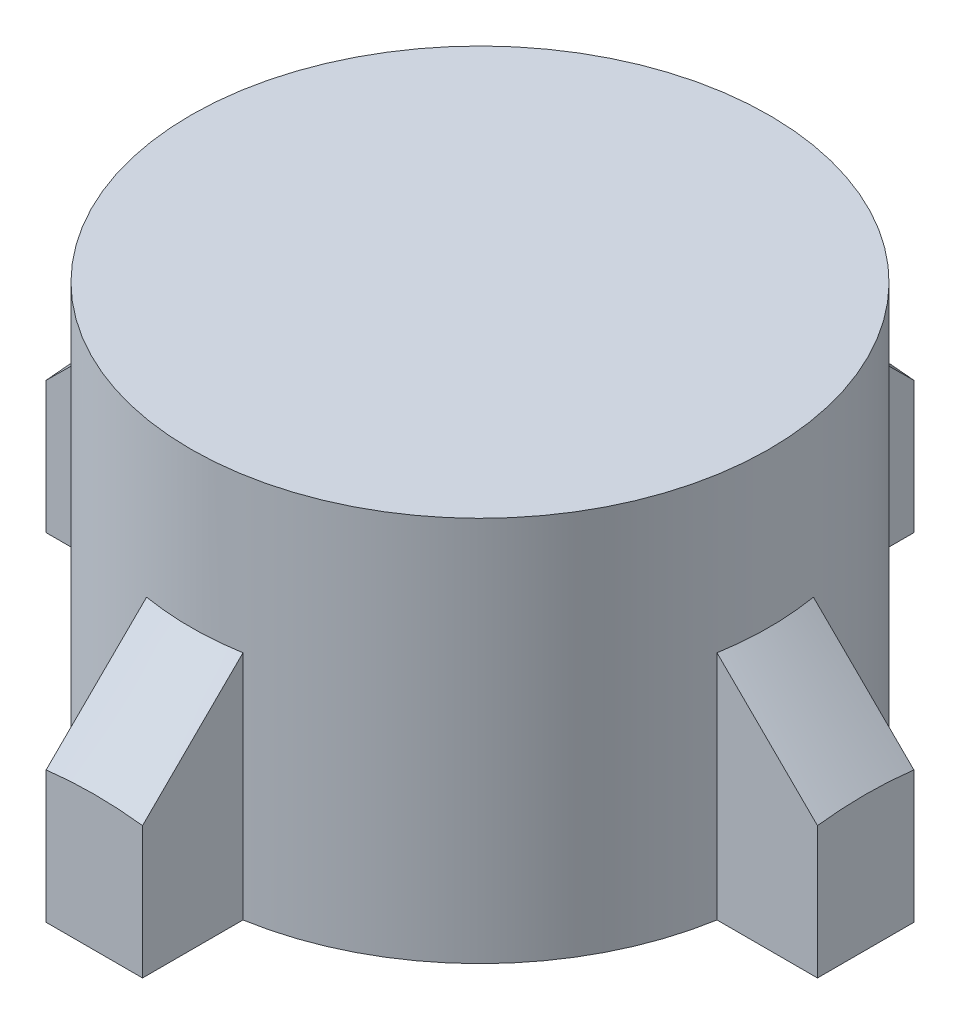
ISO-10303-21;
HEADER;
FILE_DESCRIPTION(('STEP AP214'),'2;1');
FILE_NAME('part.step','',(''),(''),'','','');
FILE_SCHEMA(('AUTOMOTIVE_DESIGN { 1 0 10303 214 1 1 1 1 }'));
ENDSEC;
DATA;
#1=APPLICATION_CONTEXT('core data for automotive mechanical design processes');
#2=APPLICATION_PROTOCOL_DEFINITION('international standard','automotive_design',2000,#1);
#3=PRODUCT_CONTEXT('',#1,'mechanical');
#4=PRODUCT('Part','Part','',(#3));
#5=PRODUCT_RELATED_PRODUCT_CATEGORY('part','',(#4));
#6=PRODUCT_DEFINITION_FORMATION('','',#4);
#7=PRODUCT_DEFINITION_CONTEXT('part definition',#1,'design');
#8=PRODUCT_DEFINITION('design','',#6,#7);
#9=PRODUCT_DEFINITION_SHAPE('','',#8);
#10=(LENGTH_UNIT() NAMED_UNIT(*) SI_UNIT(.MILLI.,.METRE.));
#11=(NAMED_UNIT(*) PLANE_ANGLE_UNIT() SI_UNIT($,.RADIAN.));
#12=(NAMED_UNIT(*) SI_UNIT($,.STERADIAN.) SOLID_ANGLE_UNIT());
#13=UNCERTAINTY_MEASURE_WITH_UNIT(LENGTH_MEASURE(1.E-05),#10,'distance_accuracy_value','');
#14=(GEOMETRIC_REPRESENTATION_CONTEXT(3) GLOBAL_UNCERTAINTY_ASSIGNED_CONTEXT((#13)) GLOBAL_UNIT_ASSIGNED_CONTEXT((#10,
#11,#12)) REPRESENTATION_CONTEXT('',''));
#15=CARTESIAN_POINT('',(0.,0.,0.));
#16=DIRECTION('',(0.,0.,1.));
#17=DIRECTION('',(1.,0.,0.));
#18=AXIS2_PLACEMENT_3D('',#15,#16,#17);
#19=CARTESIAN_POINT('',(0.,100.,0.));
#20=DIRECTION('',(0.,-1.,0.));
#21=DIRECTION('',(0.,0.,-1.));
#22=AXIS2_PLACEMENT_3D('',#19,#20,#21);
#23=CYLINDRICAL_SURFACE('',#22,75.);
#24=CARTESIAN_POINT('',(0.,100.,0.));
#25=DIRECTION('',(0.,1.,0.));
#26=DIRECTION('',(0.,0.,1.));
#27=AXIS2_PLACEMENT_3D('',#24,#25,#26);
#28=CIRCLE('',#27,75.);
#29=CARTESIAN_POINT('',(0.,100.,75.));
#30=VERTEX_POINT('',#29);
#31=EDGE_CURVE('E252',#30,#30,#28,.T.);
#32=ORIENTED_EDGE('',*,*,#31,.F.);
#33=EDGE_LOOP('',(#32));
#34=FACE_BOUND('',#33,.T.);
#35=DIRECTION('',(0.,-1.,0.));
#36=VECTOR('',#35,1.);
#37=CARTESIAN_POINT('',(12.5,10.,-73.9509972887452));
#38=LINE('',#37,#36);
#39=CARTESIAN_POINT('',(12.5,60.0000000000003,-73.9509972887452));
#40=VERTEX_POINT('',#39);
#41=CARTESIAN_POINT('',(12.5,0.,-73.9509972887452));
#42=VERTEX_POINT('',#41);
#43=EDGE_CURVE('E179',#40,#42,#38,.T.);
#44=ORIENTED_EDGE('',*,*,#43,.F.);
#45=CARTESIAN_POINT('',(0.,60.0000000000003,0.));
#46=DIRECTION('',(0.,-1.,0.));
#47=DIRECTION('',(0.,0.,-1.));
#48=AXIS2_PLACEMENT_3D('',#45,#46,#47);
#49=CIRCLE('',#48,75.);
#50=CARTESIAN_POINT('',(-12.5,60.0000000000003,-73.9509972887452));
#51=VERTEX_POINT('',#50);
#52=EDGE_CURVE('E268',#40,#51,#49,.F.);
#53=ORIENTED_EDGE('',*,*,#52,.T.);
#54=DIRECTION('',(0.,-1.,0.));
#55=VECTOR('',#54,1.);
#56=CARTESIAN_POINT('',(-12.5,10.,-73.9509972887452));
#57=LINE('',#56,#55);
#58=CARTESIAN_POINT('',(-12.5,0.,-73.9509972887452));
#59=VERTEX_POINT('',#58);
#60=EDGE_CURVE('E197',#51,#59,#57,.T.);
#61=ORIENTED_EDGE('',*,*,#60,.T.);
#62=CARTESIAN_POINT('',(0.,0.,0.));
#63=DIRECTION('',(0.,1.,0.));
#64=DIRECTION('',(0.,0.,1.));
#65=AXIS2_PLACEMENT_3D('',#62,#63,#64);
#66=CIRCLE('',#65,75.);
#67=CARTESIAN_POINT('',(-73.9509972887452,0.,-12.5));
#68=VERTEX_POINT('',#67);
#69=EDGE_CURVE('E246',#59,#68,#66,.T.);
#70=ORIENTED_EDGE('',*,*,#69,.T.);
#71=DIRECTION('',(0.,-1.,0.));
#72=VECTOR('',#71,1.);
#73=CARTESIAN_POINT('',(-73.9509972887452,10.,-12.5));
#74=LINE('',#73,#72);
#75=CARTESIAN_POINT('',(-73.9509972887452,60.0000000000003,-12.5));
#76=VERTEX_POINT('',#75);
#77=EDGE_CURVE('E247',#76,#68,#74,.T.);
#78=ORIENTED_EDGE('',*,*,#77,.F.);
#79=CARTESIAN_POINT('',(0.,60.0000000000003,0.));
#80=DIRECTION('',(0.,-1.,0.));
#81=DIRECTION('',(0.,0.,-1.));
#82=AXIS2_PLACEMENT_3D('',#79,#80,#81);
#83=CIRCLE('',#82,75.);
#84=CARTESIAN_POINT('',(-73.9509972887452,60.0000000000003,12.5));
#85=VERTEX_POINT('',#84);
#86=EDGE_CURVE('E255',#76,#85,#83,.F.);
#87=ORIENTED_EDGE('',*,*,#86,.T.);
#88=DIRECTION('',(0.,-1.,0.));
#89=VECTOR('',#88,1.);
#90=CARTESIAN_POINT('',(-73.9509972887452,10.,12.5));
#91=LINE('',#90,#89);
#92=CARTESIAN_POINT('',(-73.9509972887452,0.,12.5));
#93=VERTEX_POINT('',#92);
#94=EDGE_CURVE('E243',#85,#93,#91,.T.);
#95=ORIENTED_EDGE('',*,*,#94,.T.);
#96=CARTESIAN_POINT('',(-12.5,0.,73.9509972887452));
#97=VERTEX_POINT('',#96);
#98=EDGE_CURVE('E256',#93,#97,#66,.T.);
#99=ORIENTED_EDGE('',*,*,#98,.T.);
#100=DIRECTION('',(0.,-1.,0.));
#101=VECTOR('',#100,1.);
#102=CARTESIAN_POINT('',(-12.5,10.,73.9509972887452));
#103=LINE('',#102,#101);
#104=CARTESIAN_POINT('',(-12.5,60.0000000000004,73.9509972887452));
#105=VERTEX_POINT('',#104);
#106=EDGE_CURVE('E209',#105,#97,#103,.T.);
#107=ORIENTED_EDGE('',*,*,#106,.F.);
#108=CARTESIAN_POINT('',(0.,60.0000000000004,0.));
#109=DIRECTION('',(0.,-1.,0.));
#110=DIRECTION('',(0.,0.,-1.));
#111=AXIS2_PLACEMENT_3D('',#108,#109,#110);
#112=CIRCLE('',#111,75.);
#113=CARTESIAN_POINT('',(12.5,60.0000000000004,73.9509972887452));
#114=VERTEX_POINT('',#113);
#115=EDGE_CURVE('E262',#105,#114,#112,.F.);
#116=ORIENTED_EDGE('',*,*,#115,.T.);
#117=DIRECTION('',(0.,-1.,0.));
#118=VECTOR('',#117,1.);
#119=CARTESIAN_POINT('',(12.5,10.,73.9509972887452));
#120=LINE('',#119,#118);
#121=CARTESIAN_POINT('',(12.5,0.,73.9509972887452));
#122=VERTEX_POINT('',#121);
#123=EDGE_CURVE('E208',#114,#122,#120,.T.);
#124=ORIENTED_EDGE('',*,*,#123,.T.);
#125=CARTESIAN_POINT('',(73.9509972887452,0.,12.5));
#126=VERTEX_POINT('',#125);
#127=EDGE_CURVE('E258',#122,#126,#66,.T.);
#128=ORIENTED_EDGE('',*,*,#127,.T.);
#129=DIRECTION('',(0.,-1.,0.));
#130=VECTOR('',#129,1.);
#131=CARTESIAN_POINT('',(73.9509972887452,10.,12.5));
#132=LINE('',#131,#130);
#133=CARTESIAN_POINT('',(73.9509972887452,60.0000000000003,12.5));
#134=VERTEX_POINT('',#133);
#135=EDGE_CURVE('E231',#134,#126,#132,.T.);
#136=ORIENTED_EDGE('',*,*,#135,.F.);
#137=CARTESIAN_POINT('',(0.,60.0000000000003,0.));
#138=DIRECTION('',(0.,-1.,0.));
#139=DIRECTION('',(0.,0.,-1.));
#140=AXIS2_PLACEMENT_3D('',#137,#138,#139);
#141=CIRCLE('',#140,75.);
#142=CARTESIAN_POINT('',(73.9509972887452,60.0000000000003,-12.5));
#143=VERTEX_POINT('',#142);
#144=EDGE_CURVE('E265',#134,#143,#141,.F.);
#145=ORIENTED_EDGE('',*,*,#144,.T.);
#146=DIRECTION('',(0.,-1.,0.));
#147=VECTOR('',#146,1.);
#148=CARTESIAN_POINT('',(73.9509972887452,10.,-12.5));
#149=LINE('',#148,#147);
#150=CARTESIAN_POINT('',(73.9509972887452,0.,-12.5));
#151=VERTEX_POINT('',#150);
#152=EDGE_CURVE('E227',#143,#151,#149,.T.);
#153=ORIENTED_EDGE('',*,*,#152,.T.);
#154=EDGE_CURVE('E259',#151,#42,#66,.T.);
#155=ORIENTED_EDGE('',*,*,#154,.T.);
#156=EDGE_LOOP('',(#44,#53,#61,#70,#78,#87,#95,#99,#107,#116,#124,#128,#136,#145,#153,#155));
#157=FACE_BOUND('',#156,.T.);
#158=ADVANCED_FACE('F40',(#34,#157),#23,.T.);
#159=CARTESIAN_POINT('',(0.,100.,0.));
#160=DIRECTION('',(0.,1.,0.));
#161=DIRECTION('',(0.,0.,1.));
#162=AXIS2_PLACEMENT_3D('',#159,#160,#161);
#163=PLANE('',#162);
#164=ORIENTED_EDGE('',*,*,#31,.T.);
#165=EDGE_LOOP('',(#164));
#166=FACE_BOUND('',#165,.T.);
#167=ADVANCED_FACE('F422',(#166),#163,.T.);
#168=CARTESIAN_POINT('',(0.,0.,0.));
#169=DIRECTION('',(0.,1.,0.));
#170=DIRECTION('',(0.,0.,1.));
#171=AXIS2_PLACEMENT_3D('',#168,#169,#170);
#172=PLANE('',#171);
#173=ORIENTED_EDGE('',*,*,#98,.F.);
#174=DIRECTION('',(1.,0.,0.));
#175=VECTOR('',#174,1.);
#176=CARTESIAN_POINT('',(0.,0.,12.5));
#177=LINE('',#176,#175);
#178=CARTESIAN_POINT('',(-100.,0.,12.5));
#179=VERTEX_POINT('',#178);
#180=EDGE_CURVE('E230',#179,#93,#177,.T.);
#181=ORIENTED_EDGE('',*,*,#180,.F.);
#182=DIRECTION('',(0.,0.,1.));
#183=VECTOR('',#182,1.);
#184=CARTESIAN_POINT('',(-100.,0.,0.));
#185=LINE('',#184,#183);
#186=CARTESIAN_POINT('',(-100.,0.,-12.5));
#187=VERTEX_POINT('',#186);
#188=EDGE_CURVE('E238',#187,#179,#185,.T.);
#189=ORIENTED_EDGE('',*,*,#188,.F.);
#190=DIRECTION('',(1.,0.,0.));
#191=VECTOR('',#190,1.);
#192=CARTESIAN_POINT('',(0.,0.,-12.5));
#193=LINE('',#192,#191);
#194=EDGE_CURVE('E240',#187,#68,#193,.T.);
#195=ORIENTED_EDGE('',*,*,#194,.T.);
#196=ORIENTED_EDGE('',*,*,#69,.F.);
#197=DIRECTION('',(0.,0.,1.));
#198=VECTOR('',#197,1.);
#199=CARTESIAN_POINT('',(-12.5,0.,0.));
#200=LINE('',#199,#198);
#201=CARTESIAN_POINT('',(-12.5,0.,-100.));
#202=VERTEX_POINT('',#201);
#203=EDGE_CURVE('E180',#202,#59,#200,.T.);
#204=ORIENTED_EDGE('',*,*,#203,.F.);
#205=DIRECTION('',(1.,0.,0.));
#206=VECTOR('',#205,1.);
#207=CARTESIAN_POINT('',(0.,0.,-100.));
#208=LINE('',#207,#206);
#209=CARTESIAN_POINT('',(12.5,0.,-100.));
#210=VERTEX_POINT('',#209);
#211=EDGE_CURVE('E173',#202,#210,#208,.T.);
#212=ORIENTED_EDGE('',*,*,#211,.T.);
#213=DIRECTION('',(0.,0.,1.));
#214=VECTOR('',#213,1.);
#215=CARTESIAN_POINT('',(12.5,0.,0.));
#216=LINE('',#215,#214);
#217=EDGE_CURVE('E184',#210,#42,#216,.T.);
#218=ORIENTED_EDGE('',*,*,#217,.T.);
#219=ORIENTED_EDGE('',*,*,#154,.F.);
#220=DIRECTION('',(1.,0.,0.));
#221=VECTOR('',#220,1.);
#222=CARTESIAN_POINT('',(0.,0.,-12.5));
#223=LINE('',#222,#221);
#224=CARTESIAN_POINT('',(100.,0.,-12.5));
#225=VERTEX_POINT('',#224);
#226=EDGE_CURVE('E212',#151,#225,#223,.T.);
#227=ORIENTED_EDGE('',*,*,#226,.T.);
#228=DIRECTION('',(0.,0.,1.));
#229=VECTOR('',#228,1.);
#230=CARTESIAN_POINT('',(100.,0.,0.));
#231=LINE('',#230,#229);
#232=CARTESIAN_POINT('',(100.,0.,12.5));
#233=VERTEX_POINT('',#232);
#234=EDGE_CURVE('E222',#225,#233,#231,.T.);
#235=ORIENTED_EDGE('',*,*,#234,.T.);
#236=DIRECTION('',(1.,0.,0.));
#237=VECTOR('',#236,1.);
#238=CARTESIAN_POINT('',(0.,0.,12.5));
#239=LINE('',#238,#237);
#240=EDGE_CURVE('E225',#126,#233,#239,.T.);
#241=ORIENTED_EDGE('',*,*,#240,.F.);
#242=ORIENTED_EDGE('',*,*,#127,.F.);
#243=DIRECTION('',(0.,0.,1.));
#244=VECTOR('',#243,1.);
#245=CARTESIAN_POINT('',(12.5,0.,0.));
#246=LINE('',#245,#244);
#247=CARTESIAN_POINT('',(12.5,0.,100.));
#248=VERTEX_POINT('',#247);
#249=EDGE_CURVE('E196',#122,#248,#246,.T.);
#250=ORIENTED_EDGE('',*,*,#249,.T.);
#251=DIRECTION('',(1.,0.,0.));
#252=VECTOR('',#251,1.);
#253=CARTESIAN_POINT('',(0.,0.,100.));
#254=LINE('',#253,#252);
#255=CARTESIAN_POINT('',(-12.5,0.,100.));
#256=VERTEX_POINT('',#255);
#257=EDGE_CURVE('E203',#256,#248,#254,.T.);
#258=ORIENTED_EDGE('',*,*,#257,.F.);
#259=DIRECTION('',(0.,0.,1.));
#260=VECTOR('',#259,1.);
#261=CARTESIAN_POINT('',(-12.5,0.,0.));
#262=LINE('',#261,#260);
#263=EDGE_CURVE('E206',#97,#256,#262,.T.);
#264=ORIENTED_EDGE('',*,*,#263,.F.);
#265=EDGE_LOOP('',(#173,#181,#189,#195,#196,#204,#212,#218,#219,#227,#235,#241,#242,#250,#258,#264));
#266=FACE_BOUND('',#265,.T.);
#267=ADVANCED_FACE('F189',(#266),#172,.F.);
#268=CARTESIAN_POINT('',(0.,10.,12.5));
#269=DIRECTION('',(0.,0.,-1.));
#270=DIRECTION('',(-1.,0.,0.));
#271=AXIS2_PLACEMENT_3D('',#268,#269,#270);
#272=PLANE('',#271);
#273=ORIENTED_EDGE('',*,*,#180,.T.);
#274=ORIENTED_EDGE('',*,*,#94,.F.);
#275=CARTESIAN_POINT('',(-73.9509972887452,60.0000000000003,12.5));
#276=CARTESIAN_POINT('',(-76.125623231716,57.8557341187043,12.5));
#277=CARTESIAN_POINT('',(-78.2989925500493,55.7101948254983,12.5));
#278=CARTESIAN_POINT('',(-82.6436690014868,51.4170317982834,12.5));
#279=CARTESIAN_POINT('',(-84.814976135841,49.2694080655395,12.5));
#280=CARTESIAN_POINT('',(-89.1559813949117,44.9725364599919,12.5));
#281=CARTESIAN_POINT('',(-91.3256795200175,42.8232885875816,12.5));
#282=CARTESIAN_POINT('',(-95.6637570321255,38.5234596989376,12.5));
#283=CARTESIAN_POINT('',(-97.8321364183319,36.372878681901,12.5));
#284=CARTESIAN_POINT('',(-100.,34.2217781462687,12.5));
#285=B_SPLINE_CURVE_WITH_KNOTS('',3,(#275,#276,#277,#278,#279,#280,#281,#282,#283,#284),
.UNSPECIFIED.,.F.,.F.,(4,2,2,2,4),(0.,9.16197791707591,18.3239502767957,27.4859204184365,
36.6478960833256),.UNSPECIFIED.);
#286=CARTESIAN_POINT('',(-100.,34.2217781462687,12.5));
#287=VERTEX_POINT('',#286);
#288=EDGE_CURVE('E11',#85,#287,#285,.T.);
#289=ORIENTED_EDGE('',*,*,#288,.T.);
#290=DIRECTION('',(0.,-1.,0.));
#291=VECTOR('',#290,1.);
#292=CARTESIAN_POINT('',(-100.,10.,12.5));
#293=LINE('',#292,#291);
#294=EDGE_CURVE('E62',#287,#179,#293,.T.);
#295=ORIENTED_EDGE('',*,*,#294,.T.);
#296=EDGE_LOOP('',(#273,#274,#289,#295));
#297=FACE_BOUND('',#296,.T.);
#298=ADVANCED_FACE('F381',(#297),#272,.F.);
#299=CARTESIAN_POINT('',(0.,10.,-12.5));
#300=DIRECTION('',(0.,0.,-1.));
#301=DIRECTION('',(-1.,0.,0.));
#302=AXIS2_PLACEMENT_3D('',#299,#300,#301);
#303=PLANE('',#302);
#304=ORIENTED_EDGE('',*,*,#194,.F.);
#305=DIRECTION('',(0.,-1.,0.));
#306=VECTOR('',#305,1.);
#307=CARTESIAN_POINT('',(-100.,10.,-12.5));
#308=LINE('',#307,#306);
#309=CARTESIAN_POINT('',(-100.,34.2217781462687,-12.5));
#310=VERTEX_POINT('',#309);
#311=EDGE_CURVE('E70',#310,#187,#308,.T.);
#312=ORIENTED_EDGE('',*,*,#311,.F.);
#313=CARTESIAN_POINT('',(-100.,34.2217781462687,-12.5));
#314=CARTESIAN_POINT('',(-97.8321364183319,36.372878681901,-12.5));
#315=CARTESIAN_POINT('',(-95.6637570321255,38.5234596989376,-12.5));
#316=CARTESIAN_POINT('',(-91.3256795200175,42.8232885875816,-12.5));
#317=CARTESIAN_POINT('',(-89.1559813949117,44.9725364599919,-12.5));
#318=CARTESIAN_POINT('',(-84.814976135841,49.2694080655395,-12.5));
#319=CARTESIAN_POINT('',(-82.6436690014868,51.4170317982834,-12.5));
#320=CARTESIAN_POINT('',(-78.2989925500493,55.7101948254983,-12.5));
#321=CARTESIAN_POINT('',(-76.125623231716,57.8557341187043,-12.5));
#322=CARTESIAN_POINT('',(-73.9509972887452,60.0000000000003,-12.5));
#323=B_SPLINE_CURVE_WITH_KNOTS('',3,(#313,#314,#315,#316,#317,#318,#319,#320,#321,#322),
.UNSPECIFIED.,.F.,.F.,(4,2,2,2,4),(0.,9.16197566488912,18.3239458065299,27.4859181662497,
36.6478960833256),.UNSPECIFIED.);
#324=EDGE_CURVE('E55',#310,#76,#323,.T.);
#325=ORIENTED_EDGE('',*,*,#324,.T.);
#326=ORIENTED_EDGE('',*,*,#77,.T.);
#327=EDGE_LOOP('',(#304,#312,#325,#326));
#328=FACE_BOUND('',#327,.T.);
#329=ADVANCED_FACE('F377',(#328),#303,.T.);
#330=CARTESIAN_POINT('',(-100.,10.,0.));
#331=DIRECTION('',(1.,0.,0.));
#332=DIRECTION('',(0.,0.,-1.));
#333=AXIS2_PLACEMENT_3D('',#330,#331,#332);
#334=PLANE('',#333);
#335=ORIENTED_EDGE('',*,*,#188,.T.);
#336=ORIENTED_EDGE('',*,*,#294,.F.);
#337=CARTESIAN_POINT('',(-100.,34.2217781462687,12.5));
#338=CARTESIAN_POINT('',(-100.,34.3506081339298,11.4616275666102));
#339=CARTESIAN_POINT('',(-100.,34.4638094044752,10.4212987187302));
#340=CARTESIAN_POINT('',(-100.,34.6583725799966,8.33763969925141));
#341=CARTESIAN_POINT('',(-100.,34.7397335508538,7.29430944050269));
#342=CARTESIAN_POINT('',(-100.,34.8697755821144,5.20964362586226));
#343=CARTESIAN_POINT('',(-100.,34.9185813389614,4.16831587110397));
#344=CARTESIAN_POINT('',(-100.,34.9836933081245,2.08465873422579));
#345=CARTESIAN_POINT('',(-100.,35.0000000000006,1.04232936711289));
#346=CARTESIAN_POINT('',(-100.,35.0000000000006,-1.0423293671129));
#347=CARTESIAN_POINT('',(-100.,34.9836933081245,-2.0846587342258));
#348=CARTESIAN_POINT('',(-100.,34.9185813389614,-4.16831587110397));
#349=CARTESIAN_POINT('',(-100.,34.8697755821144,-5.20964362586226));
#350=CARTESIAN_POINT('',(-100.,34.7397335508538,-7.29430944050269));
#351=CARTESIAN_POINT('',(-100.,34.6583725799966,-8.33763969925142));
#352=CARTESIAN_POINT('',(-100.,34.4638094044752,-10.4212987187302));
#353=CARTESIAN_POINT('',(-100.,34.3506081339298,-11.4616275666102));
#354=CARTESIAN_POINT('',(-100.,34.2217781462687,-12.5));
#355=B_SPLINE_CURVE_WITH_KNOTS('',3,(#337,#338,#339,#340,#341,#342,#343,#344,#345,#346,#347,
#348,#349,#350,#351,#352,#353,#354),.UNSPECIFIED.,.F.,.F.,(4,2,2,2,2,2,2,2,4),(0.,
3.13890893259483,6.27790994642851,9.40481750559472,12.5316789234037,15.6585403412127,
18.7854479003789,21.9244489142126,25.0633578468074),.UNSPECIFIED.);
#356=EDGE_CURVE('E387',#287,#310,#355,.T.);
#357=ORIENTED_EDGE('',*,*,#356,.T.);
#358=ORIENTED_EDGE('',*,*,#311,.T.);
#359=EDGE_LOOP('',(#335,#336,#357,#358));
#360=FACE_BOUND('',#359,.T.);
#361=ADVANCED_FACE('F375',(#360),#334,.F.);
#362=CARTESIAN_POINT('',(0.,10.,-12.5));
#363=DIRECTION('',(0.,0.,-1.));
#364=DIRECTION('',(-1.,0.,0.));
#365=AXIS2_PLACEMENT_3D('',#362,#363,#364);
#366=PLANE('',#365);
#367=ORIENTED_EDGE('',*,*,#226,.F.);
#368=ORIENTED_EDGE('',*,*,#152,.F.);
#369=CARTESIAN_POINT('',(73.9509972887452,60.0000000000003,-12.5));
#370=CARTESIAN_POINT('',(76.125623231716,57.8557341187043,-12.5));
#371=CARTESIAN_POINT('',(78.2989925500493,55.7101948254984,-12.5));
#372=CARTESIAN_POINT('',(82.6436690014868,51.4170317982834,-12.5));
#373=CARTESIAN_POINT('',(84.814976135841,49.2694080655395,-12.5));
#374=CARTESIAN_POINT('',(89.1559813949116,44.9725364599919,-12.5));
#375=CARTESIAN_POINT('',(91.3256795200175,42.8232885875816,-12.5));
#376=CARTESIAN_POINT('',(95.6637570321255,38.5234596989376,-12.5));
#377=CARTESIAN_POINT('',(97.8321364183319,36.372878681901,-12.5));
#378=CARTESIAN_POINT('',(100.,34.2217781462688,-12.5));
#379=B_SPLINE_CURVE_WITH_KNOTS('',3,(#369,#370,#371,#372,#373,#374,#375,#376,#377,#378),
.UNSPECIFIED.,.F.,.F.,(4,2,2,2,4),(0.,9.16197791707589,18.3239502767957,27.4859204184365,
36.6478960833255),.UNSPECIFIED.);
#380=CARTESIAN_POINT('',(100.,34.2217781462688,-12.5));
#381=VERTEX_POINT('',#380);
#382=EDGE_CURVE('E359',#143,#381,#379,.T.);
#383=ORIENTED_EDGE('',*,*,#382,.T.);
#384=DIRECTION('',(0.,-1.,0.));
#385=VECTOR('',#384,1.);
#386=CARTESIAN_POINT('',(100.,10.,-12.5));
#387=LINE('',#386,#385);
#388=EDGE_CURVE('E87',#381,#225,#387,.T.);
#389=ORIENTED_EDGE('',*,*,#388,.T.);
#390=EDGE_LOOP('',(#367,#368,#383,#389));
#391=FACE_BOUND('',#390,.T.);
#392=ADVANCED_FACE('F368',(#391),#366,.T.);
#393=CARTESIAN_POINT('',(0.,10.,12.5));
#394=DIRECTION('',(0.,0.,-1.));
#395=DIRECTION('',(-1.,0.,0.));
#396=AXIS2_PLACEMENT_3D('',#393,#394,#395);
#397=PLANE('',#396);
#398=ORIENTED_EDGE('',*,*,#240,.T.);
#399=DIRECTION('',(0.,-1.,0.));
#400=VECTOR('',#399,1.);
#401=CARTESIAN_POINT('',(100.,10.,12.5));
#402=LINE('',#401,#400);
#403=CARTESIAN_POINT('',(100.,34.2217781462688,12.5));
#404=VERTEX_POINT('',#403);
#405=EDGE_CURVE('E95',#404,#233,#402,.T.);
#406=ORIENTED_EDGE('',*,*,#405,.F.);
#407=CARTESIAN_POINT('',(100.,34.2217781462688,12.5));
#408=CARTESIAN_POINT('',(97.8321364183319,36.3728786819011,12.5));
#409=CARTESIAN_POINT('',(95.6637570321255,38.5234596989376,12.5));
#410=CARTESIAN_POINT('',(91.3256795200175,42.8232885875816,12.5));
#411=CARTESIAN_POINT('',(89.1559813949116,44.972536459992,12.5));
#412=CARTESIAN_POINT('',(84.814976135841,49.2694080655395,12.5));
#413=CARTESIAN_POINT('',(82.6436690014868,51.4170317982834,12.5));
#414=CARTESIAN_POINT('',(78.2989925500493,55.7101948254984,12.5));
#415=CARTESIAN_POINT('',(76.125623231716,57.8557341187043,12.5));
#416=CARTESIAN_POINT('',(73.9509972887452,60.0000000000003,12.5));
#417=B_SPLINE_CURVE_WITH_KNOTS('',3,(#407,#408,#409,#410,#411,#412,#413,#414,#415,#416),
.UNSPECIFIED.,.F.,.F.,(4,2,2,2,4),(0.,9.16197566488912,18.3239458065299,27.4859181662496,
36.6478960833255),.UNSPECIFIED.);
#418=EDGE_CURVE('E353',#404,#134,#417,.T.);
#419=ORIENTED_EDGE('',*,*,#418,.T.);
#420=ORIENTED_EDGE('',*,*,#135,.T.);
#421=EDGE_LOOP('',(#398,#406,#419,#420));
#422=FACE_BOUND('',#421,.T.);
#423=ADVANCED_FACE('F365',(#422),#397,.F.);
#424=CARTESIAN_POINT('',(100.,10.,0.));
#425=DIRECTION('',(1.,0.,0.));
#426=DIRECTION('',(0.,0.,-1.));
#427=AXIS2_PLACEMENT_3D('',#424,#425,#426);
#428=PLANE('',#427);
#429=ORIENTED_EDGE('',*,*,#234,.F.);
#430=ORIENTED_EDGE('',*,*,#388,.F.);
#431=CARTESIAN_POINT('',(100.,34.2217781462688,-12.5));
#432=CARTESIAN_POINT('',(100.,34.3506081339298,-11.4616275666102));
#433=CARTESIAN_POINT('',(100.,34.4638094044752,-10.4212987187302));
#434=CARTESIAN_POINT('',(100.,34.6583725799966,-8.33763969925142));
#435=CARTESIAN_POINT('',(100.,34.7397335508538,-7.29430944050269));
#436=CARTESIAN_POINT('',(100.,34.8697755821144,-5.20964362586226));
#437=CARTESIAN_POINT('',(100.,34.9185813389615,-4.16831587110397));
#438=CARTESIAN_POINT('',(100.,34.9836933081246,-2.08465873422579));
#439=CARTESIAN_POINT('',(100.,35.0000000000006,-1.04232936711289));
#440=CARTESIAN_POINT('',(100.,35.0000000000006,1.0423293671129));
#441=CARTESIAN_POINT('',(100.,34.9836933081246,2.0846587342258));
#442=CARTESIAN_POINT('',(100.,34.9185813389615,4.16831587110397));
#443=CARTESIAN_POINT('',(100.,34.8697755821144,5.20964362586226));
#444=CARTESIAN_POINT('',(100.,34.7397335508538,7.29430944050269));
#445=CARTESIAN_POINT('',(100.,34.6583725799966,8.33763969925141));
#446=CARTESIAN_POINT('',(100.,34.4638094044752,10.4212987187302));
#447=CARTESIAN_POINT('',(100.,34.3506081339298,11.4616275666102));
#448=CARTESIAN_POINT('',(100.,34.2217781462688,12.5));
#449=B_SPLINE_CURVE_WITH_KNOTS('',3,(#431,#432,#433,#434,#435,#436,#437,#438,#439,#440,#441,
#442,#443,#444,#445,#446,#447,#448),.UNSPECIFIED.,.F.,.F.,(4,2,2,2,2,2,2,2,4),(0.,
3.13890893259483,6.27790994642851,9.40481750559472,12.5316789234037,15.6585403412127,
18.7854479003789,21.9244489142126,25.0633578468074),.UNSPECIFIED.);
#450=EDGE_CURVE('E346',#381,#404,#449,.T.);
#451=ORIENTED_EDGE('',*,*,#450,.T.);
#452=ORIENTED_EDGE('',*,*,#405,.T.);
#453=EDGE_LOOP('',(#429,#430,#451,#452));
#454=FACE_BOUND('',#453,.T.);
#455=ADVANCED_FACE('F302',(#454),#428,.T.);
#456=CARTESIAN_POINT('',(-12.5,10.,0.));
#457=DIRECTION('',(1.,0.,0.));
#458=DIRECTION('',(0.,0.,-1.));
#459=AXIS2_PLACEMENT_3D('',#456,#457,#458);
#460=PLANE('',#459);
#461=ORIENTED_EDGE('',*,*,#263,.T.);
#462=DIRECTION('',(0.,-1.,0.));
#463=VECTOR('',#462,1.);
#464=CARTESIAN_POINT('',(-12.5,10.,100.));
#465=LINE('',#464,#463);
#466=CARTESIAN_POINT('',(-12.5,34.2217781462688,100.));
#467=VERTEX_POINT('',#466);
#468=EDGE_CURVE('E213',#467,#256,#465,.T.);
#469=ORIENTED_EDGE('',*,*,#468,.F.);
#470=CARTESIAN_POINT('',(-12.5,34.2217781462688,100.));
#471=CARTESIAN_POINT('',(-12.5,36.3728786819011,97.8321364183319));
#472=CARTESIAN_POINT('',(-12.5,38.5234596989376,95.6637570321255));
#473=CARTESIAN_POINT('',(-12.5,42.8232885875816,91.3256795200175));
#474=CARTESIAN_POINT('',(-12.5,44.972536459992,89.1559813949116));
#475=CARTESIAN_POINT('',(-12.5,49.2694080655395,84.814976135841));
#476=CARTESIAN_POINT('',(-12.5,51.4170317982834,82.6436690014868));
#477=CARTESIAN_POINT('',(-12.5,55.7101948254984,78.2989925500493));
#478=CARTESIAN_POINT('',(-12.5,57.8557341187043,76.125623231716));
#479=CARTESIAN_POINT('',(-12.5,60.0000000000004,73.9509972887452));
#480=B_SPLINE_CURVE_WITH_KNOTS('',3,(#470,#471,#472,#473,#474,#475,#476,#477,#478,#479),
.UNSPECIFIED.,.F.,.F.,(4,2,2,2,4),(0.,9.16197566488912,18.3239458065299,27.4859181662497,
36.6478960833255),.UNSPECIFIED.);
#481=EDGE_CURVE('E307',#467,#105,#480,.T.);
#482=ORIENTED_EDGE('',*,*,#481,.T.);
#483=ORIENTED_EDGE('',*,*,#106,.T.);
#484=EDGE_LOOP('',(#461,#469,#482,#483));
#485=FACE_BOUND('',#484,.T.);
#486=ADVANCED_FACE('F297',(#485),#460,.F.);
#487=CARTESIAN_POINT('',(0.,10.,100.));
#488=DIRECTION('',(0.,0.,-1.));
#489=DIRECTION('',(-1.,0.,0.));
#490=AXIS2_PLACEMENT_3D('',#487,#488,#489);
#491=PLANE('',#490);
#492=ORIENTED_EDGE('',*,*,#257,.T.);
#493=DIRECTION('',(0.,-1.,0.));
#494=VECTOR('',#493,1.);
#495=CARTESIAN_POINT('',(12.5,10.,100.));
#496=LINE('',#495,#494);
#497=CARTESIAN_POINT('',(12.5,34.2217781462688,100.));
#498=VERTEX_POINT('',#497);
#499=EDGE_CURVE('E216',#498,#248,#496,.T.);
#500=ORIENTED_EDGE('',*,*,#499,.F.);
#501=CARTESIAN_POINT('',(12.5,34.2217781462688,100.));
#502=CARTESIAN_POINT('',(11.4616275666101,34.3506081339298,100.));
#503=CARTESIAN_POINT('',(10.4212987187302,34.4638094044752,100.));
#504=CARTESIAN_POINT('',(8.33763969925139,34.6583725799966,100.));
#505=CARTESIAN_POINT('',(7.29430944050266,34.7397335508538,100.));
#506=CARTESIAN_POINT('',(5.20964362586223,34.8697755821144,100.));
#507=CARTESIAN_POINT('',(4.16831587110394,34.9185813389615,100.));
#508=CARTESIAN_POINT('',(2.08465873422577,34.9836933081246,100.));
#509=CARTESIAN_POINT('',(1.04232936711287,35.0000000000006,100.));
#510=CARTESIAN_POINT('',(-1.04232936711292,35.0000000000006,100.));
#511=CARTESIAN_POINT('',(-2.08465873422582,34.9836933081246,100.));
#512=CARTESIAN_POINT('',(-4.16831587110399,34.9185813389615,100.));
#513=CARTESIAN_POINT('',(-5.20964362586229,34.8697755821144,100.));
#514=CARTESIAN_POINT('',(-7.29430944050271,34.7397335508538,100.));
#515=CARTESIAN_POINT('',(-8.33763969925144,34.6583725799966,100.));
#516=CARTESIAN_POINT('',(-10.4212987187302,34.4638094044752,100.));
#517=CARTESIAN_POINT('',(-11.4616275666102,34.3506081339298,100.));
#518=CARTESIAN_POINT('',(-12.5,34.2217781462688,100.));
#519=B_SPLINE_CURVE_WITH_KNOTS('',3,(#501,#502,#503,#504,#505,#506,#507,#508,#509,#510,#511,
#512,#513,#514,#515,#516,#517,#518),.UNSPECIFIED.,.F.,.F.,(4,2,2,2,2,2,2,2,4),(0.,
3.13890893259483,6.27790994642851,9.40481750559472,12.5316789234037,15.6585403412127,
18.7854479003789,21.9244489142126,25.0633578468074),.UNSPECIFIED.);
#520=EDGE_CURVE('E316',#498,#467,#519,.T.);
#521=ORIENTED_EDGE('',*,*,#520,.T.);
#522=ORIENTED_EDGE('',*,*,#468,.T.);
#523=EDGE_LOOP('',(#492,#500,#521,#522));
#524=FACE_BOUND('',#523,.T.);
#525=ADVANCED_FACE('F301',(#524),#491,.F.);
#526=CARTESIAN_POINT('',(12.5,10.,0.));
#527=DIRECTION('',(1.,0.,0.));
#528=DIRECTION('',(0.,0.,-1.));
#529=AXIS2_PLACEMENT_3D('',#526,#527,#528);
#530=PLANE('',#529);
#531=ORIENTED_EDGE('',*,*,#249,.F.);
#532=ORIENTED_EDGE('',*,*,#123,.F.);
#533=CARTESIAN_POINT('',(12.5,60.0000000000004,73.9509972887452));
#534=CARTESIAN_POINT('',(12.5,57.8557341187043,76.125623231716));
#535=CARTESIAN_POINT('',(12.5,55.7101948254984,78.2989925500493));
#536=CARTESIAN_POINT('',(12.5,51.4170317982834,82.6436690014868));
#537=CARTESIAN_POINT('',(12.5,49.2694080655395,84.814976135841));
#538=CARTESIAN_POINT('',(12.5,44.972536459992,89.1559813949116));
#539=CARTESIAN_POINT('',(12.5,42.8232885875816,91.3256795200175));
#540=CARTESIAN_POINT('',(12.5,38.5234596989376,95.6637570321255));
#541=CARTESIAN_POINT('',(12.5,36.372878681901,97.8321364183319));
#542=CARTESIAN_POINT('',(12.5,34.2217781462688,100.));
#543=B_SPLINE_CURVE_WITH_KNOTS('',3,(#533,#534,#535,#536,#537,#538,#539,#540,#541,#542),
.UNSPECIFIED.,.F.,.F.,(4,2,2,2,4),(0.,9.1619779170759,18.3239502767956,27.4859204184364,
36.6478960833255),.UNSPECIFIED.);
#544=EDGE_CURVE('E315',#114,#498,#543,.T.);
#545=ORIENTED_EDGE('',*,*,#544,.T.);
#546=ORIENTED_EDGE('',*,*,#499,.T.);
#547=EDGE_LOOP('',(#531,#532,#545,#546));
#548=FACE_BOUND('',#547,.T.);
#549=ADVANCED_FACE('F294',(#548),#530,.T.);
#550=CARTESIAN_POINT('',(0.,10.,-100.));
#551=DIRECTION('',(0.,0.,-1.));
#552=DIRECTION('',(-1.,0.,0.));
#553=AXIS2_PLACEMENT_3D('',#550,#551,#552);
#554=PLANE('',#553);
#555=ORIENTED_EDGE('',*,*,#211,.F.);
#556=DIRECTION('',(0.,-1.,0.));
#557=VECTOR('',#556,1.);
#558=CARTESIAN_POINT('',(-12.5,10.,-100.));
#559=LINE('',#558,#557);
#560=CARTESIAN_POINT('',(-12.5,34.2217781462687,-100.));
#561=VERTEX_POINT('',#560);
#562=EDGE_CURVE('E194',#561,#202,#559,.T.);
#563=ORIENTED_EDGE('',*,*,#562,.F.);
#564=CARTESIAN_POINT('',(-12.5,34.2217781462687,-100.));
#565=CARTESIAN_POINT('',(-11.4616275666102,34.3506081339298,-100.));
#566=CARTESIAN_POINT('',(-10.4212987187303,34.4638094044752,-100.));
#567=CARTESIAN_POINT('',(-8.33763969925144,34.6583725799966,-100.));
#568=CARTESIAN_POINT('',(-7.29430944050272,34.7397335508538,-100.));
#569=CARTESIAN_POINT('',(-5.20964362586229,34.8697755821144,-100.));
#570=CARTESIAN_POINT('',(-4.168315871104,34.9185813389614,-100.));
#571=CARTESIAN_POINT('',(-2.08465873422583,34.9836933081245,-100.));
#572=CARTESIAN_POINT('',(-1.04232936711293,35.0000000000006,-100.));
#573=CARTESIAN_POINT('',(1.04232936711287,35.0000000000006,-100.));
#574=CARTESIAN_POINT('',(2.08465873422576,34.9836933081245,-100.));
#575=CARTESIAN_POINT('',(4.16831587110394,34.9185813389614,-100.));
#576=CARTESIAN_POINT('',(5.20964362586223,34.8697755821144,-100.));
#577=CARTESIAN_POINT('',(7.29430944050266,34.7397335508538,-100.));
#578=CARTESIAN_POINT('',(8.33763969925139,34.6583725799966,-100.));
#579=CARTESIAN_POINT('',(10.4212987187302,34.4638094044752,-100.));
#580=CARTESIAN_POINT('',(11.4616275666101,34.3506081339298,-100.));
#581=CARTESIAN_POINT('',(12.5,34.2217781462687,-100.));
#582=B_SPLINE_CURVE_WITH_KNOTS('',3,(#564,#565,#566,#567,#568,#569,#570,#571,#572,#573,#574,
#575,#576,#577,#578,#579,#580,#581),.UNSPECIFIED.,.F.,.F.,(4,2,2,2,2,2,2,2,4),(0.,
3.13890893259482,6.2779099464285,9.40481750559471,12.5316789234037,15.6585403412127,
18.7854479003789,21.9244489142126,25.0633578468074),.UNSPECIFIED.);
#583=CARTESIAN_POINT('',(12.5,34.2217781462687,-100.));
#584=VERTEX_POINT('',#583);
#585=EDGE_CURVE('E175',#561,#584,#582,.T.);
#586=ORIENTED_EDGE('',*,*,#585,.T.);
#587=DIRECTION('',(0.,-1.,0.));
#588=VECTOR('',#587,1.);
#589=CARTESIAN_POINT('',(12.5,10.,-100.));
#590=LINE('',#589,#588);
#591=EDGE_CURVE('E169',#584,#210,#590,.T.);
#592=ORIENTED_EDGE('',*,*,#591,.T.);
#593=EDGE_LOOP('',(#555,#563,#586,#592));
#594=FACE_BOUND('',#593,.T.);
#595=ADVANCED_FACE('F171',(#594),#554,.T.);
#596=CARTESIAN_POINT('',(-12.5,10.,0.));
#597=DIRECTION('',(1.,0.,0.));
#598=DIRECTION('',(0.,0.,-1.));
#599=AXIS2_PLACEMENT_3D('',#596,#597,#598);
#600=PLANE('',#599);
#601=ORIENTED_EDGE('',*,*,#203,.T.);
#602=ORIENTED_EDGE('',*,*,#60,.F.);
#603=CARTESIAN_POINT('',(-12.5,60.0000000000003,-73.9509972887452));
#604=CARTESIAN_POINT('',(-12.5,57.8557341187043,-76.125623231716));
#605=CARTESIAN_POINT('',(-12.5,55.7101948254983,-78.2989925500493));
#606=CARTESIAN_POINT('',(-12.5,51.4170317982834,-82.6436690014868));
#607=CARTESIAN_POINT('',(-12.5,49.2694080655395,-84.814976135841));
#608=CARTESIAN_POINT('',(-12.5,44.9725364599919,-89.1559813949117));
#609=CARTESIAN_POINT('',(-12.5,42.8232885875816,-91.3256795200175));
#610=CARTESIAN_POINT('',(-12.5,38.5234596989376,-95.6637570321255));
#611=CARTESIAN_POINT('',(-12.5,36.372878681901,-97.8321364183319));
#612=CARTESIAN_POINT('',(-12.5,34.2217781462687,-100.));
#613=B_SPLINE_CURVE_WITH_KNOTS('',3,(#603,#604,#605,#606,#607,#608,#609,#610,#611,#612),
.UNSPECIFIED.,.F.,.F.,(4,2,2,2,4),(0.,9.16197791707591,18.3239502767957,27.4859204184365,
36.6478960833256),.UNSPECIFIED.);
#614=EDGE_CURVE('E408',#51,#561,#613,.T.);
#615=ORIENTED_EDGE('',*,*,#614,.T.);
#616=ORIENTED_EDGE('',*,*,#562,.T.);
#617=EDGE_LOOP('',(#601,#602,#615,#616));
#618=FACE_BOUND('',#617,.T.);
#619=ADVANCED_FACE('F293',(#618),#600,.F.);
#620=CARTESIAN_POINT('',(12.5,10.,0.));
#621=DIRECTION('',(1.,0.,0.));
#622=DIRECTION('',(0.,0.,-1.));
#623=AXIS2_PLACEMENT_3D('',#620,#621,#622);
#624=PLANE('',#623);
#625=ORIENTED_EDGE('',*,*,#217,.F.);
#626=ORIENTED_EDGE('',*,*,#591,.F.);
#627=CARTESIAN_POINT('',(12.5,34.2217781462687,-100.));
#628=CARTESIAN_POINT('',(12.5,36.372878681901,-97.8321364183319));
#629=CARTESIAN_POINT('',(12.5,38.5234596989376,-95.6637570321255));
#630=CARTESIAN_POINT('',(12.5,42.8232885875816,-91.3256795200175));
#631=CARTESIAN_POINT('',(12.5,44.9725364599919,-89.1559813949117));
#632=CARTESIAN_POINT('',(12.5,49.2694080655395,-84.814976135841));
#633=CARTESIAN_POINT('',(12.5,51.4170317982834,-82.6436690014868));
#634=CARTESIAN_POINT('',(12.5,55.7101948254984,-78.2989925500493));
#635=CARTESIAN_POINT('',(12.5,57.8557341187043,-76.125623231716));
#636=CARTESIAN_POINT('',(12.5,60.0000000000004,-73.9509972887452));
#637=B_SPLINE_CURVE_WITH_KNOTS('',3,(#627,#628,#629,#630,#631,#632,#633,#634,#635,#636),
.UNSPECIFIED.,.F.,.F.,(4,2,2,2,4),(0.,9.16197566488912,18.3239458065299,27.4859181662497,
36.6478960833256),.UNSPECIFIED.);
#638=EDGE_CURVE('E278',#584,#40,#637,.T.);
#639=ORIENTED_EDGE('',*,*,#638,.T.);
#640=ORIENTED_EDGE('',*,*,#43,.T.);
#641=EDGE_LOOP('',(#625,#626,#639,#640));
#642=FACE_BOUND('',#641,.T.);
#643=ADVANCED_FACE('F185',(#642),#624,.T.);
#644=CARTESIAN_POINT('',(0.,9.99999999999999,0.));
#645=DIRECTION('',(0.,-1.,0.));
#646=DIRECTION('',(0.,0.,-1.));
#647=AXIS2_PLACEMENT_3D('',#644,#645,#646);
#648=CONICAL_SURFACE('',#647,125.000000000001,0.785398163397453);
#649=ORIENTED_EDGE('',*,*,#614,.F.);
#650=ORIENTED_EDGE('',*,*,#52,.F.);
#651=ORIENTED_EDGE('',*,*,#638,.F.);
#652=ORIENTED_EDGE('',*,*,#585,.F.);
#653=EDGE_LOOP('',(#649,#650,#651,#652));
#654=FACE_BOUND('',#653,.T.);
#655=ADVANCED_FACE('F286',(#654),#648,.T.);
#656=CARTESIAN_POINT('',(0.,9.99999999999999,0.));
#657=DIRECTION('',(0.,-1.,0.));
#658=DIRECTION('',(0.,0.,-1.));
#659=AXIS2_PLACEMENT_3D('',#656,#657,#658);
#660=CONICAL_SURFACE('',#659,125.000000000001,0.785398163397453);
#661=ORIENTED_EDGE('',*,*,#382,.F.);
#662=ORIENTED_EDGE('',*,*,#144,.F.);
#663=ORIENTED_EDGE('',*,*,#418,.F.);
#664=ORIENTED_EDGE('',*,*,#450,.F.);
#665=EDGE_LOOP('',(#661,#662,#663,#664));
#666=FACE_BOUND('',#665,.T.);
#667=ADVANCED_FACE('F334',(#666),#660,.T.);
#668=CARTESIAN_POINT('',(0.,9.99999999999999,0.));
#669=DIRECTION('',(0.,-1.,0.));
#670=DIRECTION('',(0.,0.,-1.));
#671=AXIS2_PLACEMENT_3D('',#668,#669,#670);
#672=CONICAL_SURFACE('',#671,125.000000000001,0.785398163397453);
#673=ORIENTED_EDGE('',*,*,#544,.F.);
#674=ORIENTED_EDGE('',*,*,#115,.F.);
#675=ORIENTED_EDGE('',*,*,#481,.F.);
#676=ORIENTED_EDGE('',*,*,#520,.F.);
#677=EDGE_LOOP('',(#673,#674,#675,#676));
#678=FACE_BOUND('',#677,.T.);
#679=ADVANCED_FACE('F328',(#678),#672,.T.);
#680=CARTESIAN_POINT('',(0.,9.99999999999999,0.));
#681=DIRECTION('',(0.,-1.,0.));
#682=DIRECTION('',(0.,0.,-1.));
#683=AXIS2_PLACEMENT_3D('',#680,#681,#682);
#684=CONICAL_SURFACE('',#683,125.000000000001,0.785398163397453);
#685=ORIENTED_EDGE('',*,*,#288,.F.);
#686=ORIENTED_EDGE('',*,*,#86,.F.);
#687=ORIENTED_EDGE('',*,*,#324,.F.);
#688=ORIENTED_EDGE('',*,*,#356,.F.);
#689=EDGE_LOOP('',(#685,#686,#687,#688));
#690=FACE_BOUND('',#689,.T.);
#691=ADVANCED_FACE('F43',(#690),#684,.T.);
#692=CLOSED_SHELL('',(#158,#167,#267,#298,#329,#361,#392,#423,#455,#486,#525,#549,#595,#619,
#643,#655,#667,#679,#691));
#693=MANIFOLD_SOLID_BREP('B2',#692);
#694=ADVANCED_BREP_SHAPE_REPRESENTATION('',(#18,#693),#14);
#695=SHAPE_DEFINITION_REPRESENTATION(#9,#694);
ENDSEC;
END-ISO-10303-21;
